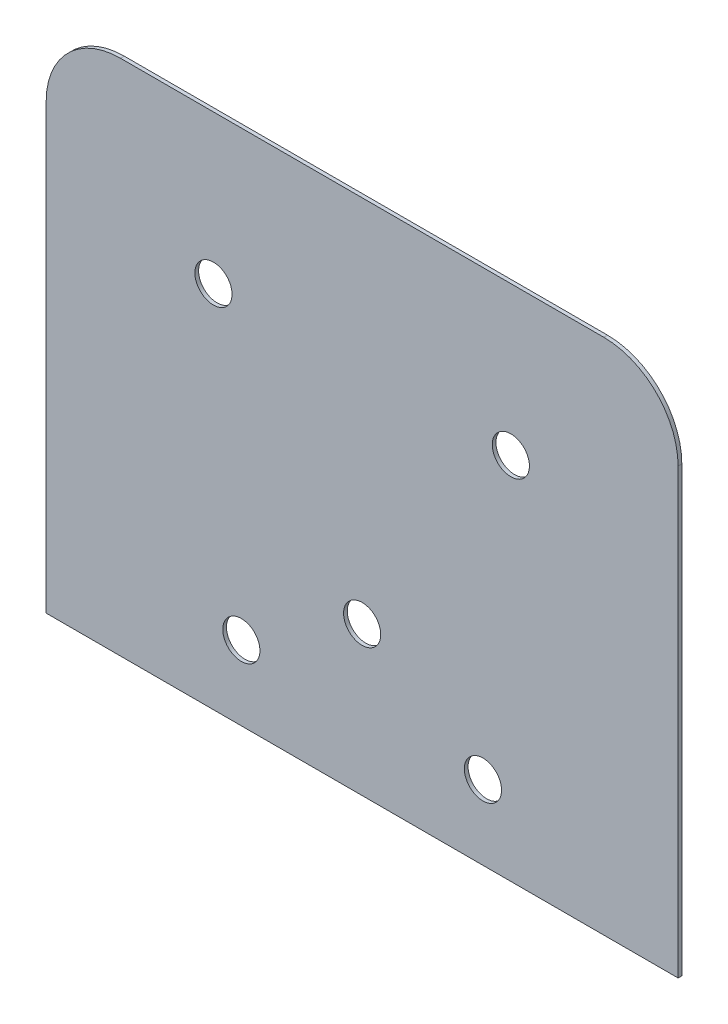
ISO-10303-21;
HEADER;
FILE_DESCRIPTION(('STEP AP214'),'2;1');
FILE_NAME('part.step','',(''),(''),'','','');
FILE_SCHEMA(('AUTOMOTIVE_DESIGN { 1 0 10303 214 1 1 1 1 }'));
ENDSEC;
DATA;
#1=APPLICATION_CONTEXT('core data for automotive mechanical design processes');
#2=APPLICATION_PROTOCOL_DEFINITION('international standard','automotive_design',2000,#1);
#3=PRODUCT_CONTEXT('',#1,'mechanical');
#4=PRODUCT('Part','Part','',(#3));
#5=PRODUCT_RELATED_PRODUCT_CATEGORY('part','',(#4));
#6=PRODUCT_DEFINITION_FORMATION('','',#4);
#7=PRODUCT_DEFINITION_CONTEXT('part definition',#1,'design');
#8=PRODUCT_DEFINITION('design','',#6,#7);
#9=PRODUCT_DEFINITION_SHAPE('','',#8);
#10=(LENGTH_UNIT() NAMED_UNIT(*) SI_UNIT(.MILLI.,.METRE.));
#11=(NAMED_UNIT(*) PLANE_ANGLE_UNIT() SI_UNIT($,.RADIAN.));
#12=(NAMED_UNIT(*) SI_UNIT($,.STERADIAN.) SOLID_ANGLE_UNIT());
#13=UNCERTAINTY_MEASURE_WITH_UNIT(LENGTH_MEASURE(1.E-05),#10,'distance_accuracy_value','');
#14=(GEOMETRIC_REPRESENTATION_CONTEXT(3) GLOBAL_UNCERTAINTY_ASSIGNED_CONTEXT((#13)) GLOBAL_UNIT_ASSIGNED_CONTEXT((#10,
#11,#12)) REPRESENTATION_CONTEXT('',''));
#15=CARTESIAN_POINT('',(0.,0.,0.));
#16=DIRECTION('',(0.,0.,1.));
#17=DIRECTION('',(1.,0.,0.));
#18=AXIS2_PLACEMENT_3D('',#15,#16,#17);
#19=CARTESIAN_POINT('',(-35.,0.,1.));
#20=DIRECTION('',(-1.,0.,0.));
#21=DIRECTION('',(0.,0.,1.));
#22=AXIS2_PLACEMENT_3D('',#19,#20,#21);
#23=PLANE('',#22);
#24=DIRECTION('',(0.,1.,0.));
#25=VECTOR('',#24,1.);
#26=CARTESIAN_POINT('',(-35.,0.,0.));
#27=LINE('',#26,#25);
#28=CARTESIAN_POINT('',(-35.,178.888220281707,0.));
#29=VERTEX_POINT('',#28);
#30=CARTESIAN_POINT('',(-35.,298.171952775904,0.));
#31=VERTEX_POINT('',#30);
#32=EDGE_CURVE('E137',#29,#31,#27,.T.);
#33=ORIENTED_EDGE('',*,*,#32,.T.);
#34=DIRECTION('',(0.,0.,-1.));
#35=VECTOR('',#34,1.);
#36=CARTESIAN_POINT('',(-35.,298.171952775904,1.));
#37=LINE('',#36,#35);
#38=CARTESIAN_POINT('',(-35.,298.171952775904,1.));
#39=VERTEX_POINT('',#38);
#40=EDGE_CURVE('E11',#39,#31,#37,.T.);
#41=ORIENTED_EDGE('',*,*,#40,.F.);
#42=DIRECTION('',(0.,1.,0.));
#43=VECTOR('',#42,1.);
#44=CARTESIAN_POINT('',(-35.,0.,1.));
#45=LINE('',#44,#43);
#46=CARTESIAN_POINT('',(-35.,178.888220281707,1.));
#47=VERTEX_POINT('',#46);
#48=EDGE_CURVE('E163',#47,#39,#45,.T.);
#49=ORIENTED_EDGE('',*,*,#48,.F.);
#50=DIRECTION('',(0.,0.,-1.));
#51=VECTOR('',#50,1.);
#52=CARTESIAN_POINT('',(-35.,178.888220281707,1.));
#53=LINE('',#52,#51);
#54=EDGE_CURVE('E118',#47,#29,#53,.T.);
#55=ORIENTED_EDGE('',*,*,#54,.T.);
#56=EDGE_LOOP('',(#33,#41,#49,#55));
#57=FACE_BOUND('',#56,.T.);
#58=ADVANCED_FACE('F39',(#57),#23,.F.);
#59=CARTESIAN_POINT('',(-55.,298.171952775904,1.));
#60=DIRECTION('',(0.,0.,-1.));
#61=DIRECTION('',(-1.,0.,0.));
#62=AXIS2_PLACEMENT_3D('',#59,#60,#61);
#63=CYLINDRICAL_SURFACE('',#62,20.);
#64=CARTESIAN_POINT('',(-55.,298.171952775904,0.));
#65=DIRECTION('',(0.,0.,1.));
#66=DIRECTION('',(1.,0.,0.));
#67=AXIS2_PLACEMENT_3D('',#64,#65,#66);
#68=CIRCLE('',#67,20.);
#69=CARTESIAN_POINT('',(-55.,318.171952775904,0.));
#70=VERTEX_POINT('',#69);
#71=EDGE_CURVE('E140',#31,#70,#68,.T.);
#72=ORIENTED_EDGE('',*,*,#71,.T.);
#73=DIRECTION('',(0.,0.,-1.));
#74=VECTOR('',#73,1.);
#75=CARTESIAN_POINT('',(-55.,318.171952775904,1.));
#76=LINE('',#75,#74);
#77=CARTESIAN_POINT('',(-55.,318.171952775904,1.));
#78=VERTEX_POINT('',#77);
#79=EDGE_CURVE('E48',#78,#70,#76,.T.);
#80=ORIENTED_EDGE('',*,*,#79,.F.);
#81=CARTESIAN_POINT('',(-55.,298.171952775904,1.));
#82=DIRECTION('',(0.,0.,1.));
#83=DIRECTION('',(1.,0.,0.));
#84=AXIS2_PLACEMENT_3D('',#81,#82,#83);
#85=CIRCLE('',#84,20.);
#86=EDGE_CURVE('E89',#39,#78,#85,.T.);
#87=ORIENTED_EDGE('',*,*,#86,.F.);
#88=ORIENTED_EDGE('',*,*,#40,.T.);
#89=EDGE_LOOP('',(#72,#80,#87,#88));
#90=FACE_BOUND('',#89,.T.);
#91=ADVANCED_FACE('F156',(#90),#63,.T.);
#92=CARTESIAN_POINT('',(0.,318.171952775904,1.));
#93=DIRECTION('',(0.,1.,0.));
#94=DIRECTION('',(0.,0.,1.));
#95=AXIS2_PLACEMENT_3D('',#92,#93,#94);
#96=PLANE('',#95);
#97=DIRECTION('',(1.,0.,0.));
#98=VECTOR('',#97,1.);
#99=CARTESIAN_POINT('',(0.,318.171952775904,0.));
#100=LINE('',#99,#98);
#101=CARTESIAN_POINT('',(-185.,318.171952775904,0.));
#102=VERTEX_POINT('',#101);
#103=EDGE_CURVE('E143',#102,#70,#100,.T.);
#104=ORIENTED_EDGE('',*,*,#103,.F.);
#105=DIRECTION('',(0.,0.,-1.));
#106=VECTOR('',#105,1.);
#107=CARTESIAN_POINT('',(-185.,318.171952775904,1.));
#108=LINE('',#107,#106);
#109=CARTESIAN_POINT('',(-185.,318.171952775904,1.));
#110=VERTEX_POINT('',#109);
#111=EDGE_CURVE('E114',#110,#102,#108,.T.);
#112=ORIENTED_EDGE('',*,*,#111,.F.);
#113=DIRECTION('',(1.,0.,0.));
#114=VECTOR('',#113,1.);
#115=CARTESIAN_POINT('',(0.,318.171952775904,1.));
#116=LINE('',#115,#114);
#117=EDGE_CURVE('E103',#110,#78,#116,.T.);
#118=ORIENTED_EDGE('',*,*,#117,.T.);
#119=ORIENTED_EDGE('',*,*,#79,.T.);
#120=EDGE_LOOP('',(#104,#112,#118,#119));
#121=FACE_BOUND('',#120,.T.);
#122=ADVANCED_FACE('F155',(#121),#96,.T.);
#123=CARTESIAN_POINT('',(-185.,298.171952775904,1.));
#124=DIRECTION('',(0.,0.,-1.));
#125=DIRECTION('',(-1.,0.,0.));
#126=AXIS2_PLACEMENT_3D('',#123,#124,#125);
#127=CYLINDRICAL_SURFACE('',#126,20.);
#128=CARTESIAN_POINT('',(-185.,298.171952775904,0.));
#129=DIRECTION('',(0.,0.,1.));
#130=DIRECTION('',(1.,0.,0.));
#131=AXIS2_PLACEMENT_3D('',#128,#129,#130);
#132=CIRCLE('',#131,20.);
#133=CARTESIAN_POINT('',(-205.,298.171952775904,0.));
#134=VERTEX_POINT('',#133);
#135=EDGE_CURVE('E110',#102,#134,#132,.T.);
#136=ORIENTED_EDGE('',*,*,#135,.T.);
#137=DIRECTION('',(0.,0.,-1.));
#138=VECTOR('',#137,1.);
#139=CARTESIAN_POINT('',(-205.,298.171952775904,1.));
#140=LINE('',#139,#138);
#141=CARTESIAN_POINT('',(-205.,298.171952775904,1.));
#142=VERTEX_POINT('',#141);
#143=EDGE_CURVE('E107',#142,#134,#140,.T.);
#144=ORIENTED_EDGE('',*,*,#143,.F.);
#145=CARTESIAN_POINT('',(-185.,298.171952775904,1.));
#146=DIRECTION('',(0.,0.,1.));
#147=DIRECTION('',(1.,0.,0.));
#148=AXIS2_PLACEMENT_3D('',#145,#146,#147);
#149=CIRCLE('',#148,20.);
#150=EDGE_CURVE('E97',#110,#142,#149,.T.);
#151=ORIENTED_EDGE('',*,*,#150,.F.);
#152=ORIENTED_EDGE('',*,*,#111,.T.);
#153=EDGE_LOOP('',(#136,#144,#151,#152));
#154=FACE_BOUND('',#153,.T.);
#155=ADVANCED_FACE('F108',(#154),#127,.T.);
#156=CARTESIAN_POINT('',(-205.,0.,1.));
#157=DIRECTION('',(-1.,0.,0.));
#158=DIRECTION('',(0.,0.,1.));
#159=AXIS2_PLACEMENT_3D('',#156,#157,#158);
#160=PLANE('',#159);
#161=DIRECTION('',(0.,1.,0.));
#162=VECTOR('',#161,1.);
#163=CARTESIAN_POINT('',(-205.,0.,0.));
#164=LINE('',#163,#162);
#165=CARTESIAN_POINT('',(-205.,178.888220281707,0.));
#166=VERTEX_POINT('',#165);
#167=EDGE_CURVE('E147',#166,#134,#164,.T.);
#168=ORIENTED_EDGE('',*,*,#167,.F.);
#169=DIRECTION('',(0.,0.,-1.));
#170=VECTOR('',#169,1.);
#171=CARTESIAN_POINT('',(-205.,178.888220281707,1.));
#172=LINE('',#171,#170);
#173=CARTESIAN_POINT('',(-205.,178.888220281707,1.));
#174=VERTEX_POINT('',#173);
#175=EDGE_CURVE('E78',#174,#166,#172,.T.);
#176=ORIENTED_EDGE('',*,*,#175,.F.);
#177=DIRECTION('',(0.,1.,0.));
#178=VECTOR('',#177,1.);
#179=CARTESIAN_POINT('',(-205.,0.,1.));
#180=LINE('',#179,#178);
#181=EDGE_CURVE('E101',#174,#142,#180,.T.);
#182=ORIENTED_EDGE('',*,*,#181,.T.);
#183=ORIENTED_EDGE('',*,*,#143,.T.);
#184=EDGE_LOOP('',(#168,#176,#182,#183));
#185=FACE_BOUND('',#184,.T.);
#186=ADVANCED_FACE('F116',(#185),#160,.T.);
#187=CARTESIAN_POINT('',(-160.,278.171952775904,1.));
#188=DIRECTION('',(0.,0.,-1.));
#189=DIRECTION('',(-1.,0.,0.));
#190=AXIS2_PLACEMENT_3D('',#187,#188,#189);
#191=CYLINDRICAL_SURFACE('',#190,4.99999999999999);
#192=CARTESIAN_POINT('',(-160.,278.171952775904,1.));
#193=DIRECTION('',(0.,0.,1.));
#194=DIRECTION('',(1.,0.,0.));
#195=AXIS2_PLACEMENT_3D('',#192,#193,#194);
#196=CIRCLE('',#195,4.99999999999999);
#197=CARTESIAN_POINT('',(-155.,278.171952775904,1.));
#198=VERTEX_POINT('',#197);
#199=EDGE_CURVE('E338',#198,#198,#196,.T.);
#200=ORIENTED_EDGE('',*,*,#199,.T.);
#201=EDGE_LOOP('',(#200));
#202=FACE_BOUND('',#201,.T.);
#203=CARTESIAN_POINT('',(-160.,278.171952775904,0.));
#204=DIRECTION('',(0.,0.,1.));
#205=DIRECTION('',(1.,0.,0.));
#206=AXIS2_PLACEMENT_3D('',#203,#204,#205);
#207=CIRCLE('',#206,4.99999999999999);
#208=CARTESIAN_POINT('',(-155.,278.171952775904,0.));
#209=VERTEX_POINT('',#208);
#210=EDGE_CURVE('E134',#209,#209,#207,.T.);
#211=ORIENTED_EDGE('',*,*,#210,.F.);
#212=EDGE_LOOP('',(#211));
#213=FACE_BOUND('',#212,.T.);
#214=ADVANCED_FACE('F185',(#202,#213),#191,.F.);
#215=CARTESIAN_POINT('',(-80.,278.171952775904,1.));
#216=DIRECTION('',(0.,0.,-1.));
#217=DIRECTION('',(-1.,0.,0.));
#218=AXIS2_PLACEMENT_3D('',#215,#216,#217);
#219=CYLINDRICAL_SURFACE('',#218,5.00000000000001);
#220=CARTESIAN_POINT('',(-80.,278.171952775904,1.));
#221=DIRECTION('',(0.,0.,1.));
#222=DIRECTION('',(1.,0.,0.));
#223=AXIS2_PLACEMENT_3D('',#220,#221,#222);
#224=CIRCLE('',#223,5.00000000000001);
#225=CARTESIAN_POINT('',(-75.,278.171952775904,1.));
#226=VERTEX_POINT('',#225);
#227=EDGE_CURVE('E331',#226,#226,#224,.T.);
#228=ORIENTED_EDGE('',*,*,#227,.T.);
#229=EDGE_LOOP('',(#228));
#230=FACE_BOUND('',#229,.T.);
#231=CARTESIAN_POINT('',(-80.,278.171952775904,0.));
#232=DIRECTION('',(0.,0.,1.));
#233=DIRECTION('',(1.,0.,0.));
#234=AXIS2_PLACEMENT_3D('',#231,#232,#233);
#235=CIRCLE('',#234,5.00000000000001);
#236=CARTESIAN_POINT('',(-75.,278.171952775904,0.));
#237=VERTEX_POINT('',#236);
#238=EDGE_CURVE('E131',#237,#237,#235,.T.);
#239=ORIENTED_EDGE('',*,*,#238,.F.);
#240=EDGE_LOOP('',(#239));
#241=FACE_BOUND('',#240,.T.);
#242=ADVANCED_FACE('F188',(#230,#241),#219,.F.);
#243=CARTESIAN_POINT('',(-152.5,198.888220281707,1.));
#244=DIRECTION('',(0.,0.,-1.));
#245=DIRECTION('',(-1.,0.,0.));
#246=AXIS2_PLACEMENT_3D('',#243,#244,#245);
#247=CYLINDRICAL_SURFACE('',#246,5.00000000000002);
#248=CARTESIAN_POINT('',(-152.5,198.888220281707,1.));
#249=DIRECTION('',(0.,0.,1.));
#250=DIRECTION('',(1.,0.,0.));
#251=AXIS2_PLACEMENT_3D('',#248,#249,#250);
#252=CIRCLE('',#251,5.00000000000002);
#253=CARTESIAN_POINT('',(-147.5,198.888220281707,1.));
#254=VERTEX_POINT('',#253);
#255=EDGE_CURVE('E328',#254,#254,#252,.T.);
#256=ORIENTED_EDGE('',*,*,#255,.T.);
#257=EDGE_LOOP('',(#256));
#258=FACE_BOUND('',#257,.T.);
#259=CARTESIAN_POINT('',(-152.5,198.888220281707,0.));
#260=DIRECTION('',(0.,0.,1.));
#261=DIRECTION('',(1.,0.,0.));
#262=AXIS2_PLACEMENT_3D('',#259,#260,#261);
#263=CIRCLE('',#262,5.00000000000002);
#264=CARTESIAN_POINT('',(-147.5,198.888220281707,0.));
#265=VERTEX_POINT('',#264);
#266=EDGE_CURVE('E128',#265,#265,#263,.T.);
#267=ORIENTED_EDGE('',*,*,#266,.F.);
#268=EDGE_LOOP('',(#267));
#269=FACE_BOUND('',#268,.T.);
#270=ADVANCED_FACE('F192',(#258,#269),#247,.F.);
#271=CARTESIAN_POINT('',(-120.,218.888220281707,1.));
#272=DIRECTION('',(0.,0.,-1.));
#273=DIRECTION('',(-1.,0.,0.));
#274=AXIS2_PLACEMENT_3D('',#271,#272,#273);
#275=CYLINDRICAL_SURFACE('',#274,5.00000000000001);
#276=CARTESIAN_POINT('',(-120.,218.888220281707,1.));
#277=DIRECTION('',(0.,0.,1.));
#278=DIRECTION('',(1.,0.,0.));
#279=AXIS2_PLACEMENT_3D('',#276,#277,#278);
#280=CIRCLE('',#279,5.00000000000001);
#281=CARTESIAN_POINT('',(-115.,218.888220281707,1.));
#282=VERTEX_POINT('',#281);
#283=EDGE_CURVE('E203',#282,#282,#280,.T.);
#284=ORIENTED_EDGE('',*,*,#283,.T.);
#285=EDGE_LOOP('',(#284));
#286=FACE_BOUND('',#285,.T.);
#287=CARTESIAN_POINT('',(-120.,218.888220281707,0.));
#288=DIRECTION('',(0.,0.,1.));
#289=DIRECTION('',(1.,0.,0.));
#290=AXIS2_PLACEMENT_3D('',#287,#288,#289);
#291=CIRCLE('',#290,5.00000000000001);
#292=CARTESIAN_POINT('',(-115.,218.888220281707,0.));
#293=VERTEX_POINT('',#292);
#294=EDGE_CURVE('E125',#293,#293,#291,.T.);
#295=ORIENTED_EDGE('',*,*,#294,.F.);
#296=EDGE_LOOP('',(#295));
#297=FACE_BOUND('',#296,.T.);
#298=ADVANCED_FACE('F173',(#286,#297),#275,.F.);
#299=CARTESIAN_POINT('',(-87.5,198.888220281707,1.));
#300=DIRECTION('',(0.,0.,-1.));
#301=DIRECTION('',(-1.,0.,0.));
#302=AXIS2_PLACEMENT_3D('',#299,#300,#301);
#303=CYLINDRICAL_SURFACE('',#302,5.00000000000001);
#304=CARTESIAN_POINT('',(-87.5,198.888220281707,1.));
#305=DIRECTION('',(0.,0.,1.));
#306=DIRECTION('',(1.,0.,0.));
#307=AXIS2_PLACEMENT_3D('',#304,#305,#306);
#308=CIRCLE('',#307,5.00000000000001);
#309=CARTESIAN_POINT('',(-82.5,198.888220281707,1.));
#310=VERTEX_POINT('',#309);
#311=EDGE_CURVE('E150',#310,#310,#308,.T.);
#312=ORIENTED_EDGE('',*,*,#311,.T.);
#313=EDGE_LOOP('',(#312));
#314=FACE_BOUND('',#313,.T.);
#315=CARTESIAN_POINT('',(-87.5,198.888220281707,0.));
#316=DIRECTION('',(0.,0.,1.));
#317=DIRECTION('',(1.,0.,0.));
#318=AXIS2_PLACEMENT_3D('',#315,#316,#317);
#319=CIRCLE('',#318,5.00000000000001);
#320=CARTESIAN_POINT('',(-82.5,198.888220281707,0.));
#321=VERTEX_POINT('',#320);
#322=EDGE_CURVE('E122',#321,#321,#319,.T.);
#323=ORIENTED_EDGE('',*,*,#322,.F.);
#324=EDGE_LOOP('',(#323));
#325=FACE_BOUND('',#324,.T.);
#326=ADVANCED_FACE('F41',(#314,#325),#303,.F.);
#327=CARTESIAN_POINT('',(0.,178.888220281707,1.));
#328=DIRECTION('',(0.,1.,0.));
#329=DIRECTION('',(0.,0.,1.));
#330=AXIS2_PLACEMENT_3D('',#327,#328,#329);
#331=PLANE('',#330);
#332=DIRECTION('',(1.,0.,0.));
#333=VECTOR('',#332,1.);
#334=CARTESIAN_POINT('',(0.,178.888220281707,0.));
#335=LINE('',#334,#333);
#336=EDGE_CURVE('E81',#166,#29,#335,.T.);
#337=ORIENTED_EDGE('',*,*,#336,.T.);
#338=ORIENTED_EDGE('',*,*,#54,.F.);
#339=DIRECTION('',(1.,0.,0.));
#340=VECTOR('',#339,1.);
#341=CARTESIAN_POINT('',(0.,178.888220281707,1.));
#342=LINE('',#341,#340);
#343=EDGE_CURVE('E56',#174,#47,#342,.T.);
#344=ORIENTED_EDGE('',*,*,#343,.F.);
#345=ORIENTED_EDGE('',*,*,#175,.T.);
#346=EDGE_LOOP('',(#337,#338,#344,#345));
#347=FACE_BOUND('',#346,.T.);
#348=ADVANCED_FACE('F164',(#347),#331,.F.);
#349=CARTESIAN_POINT('',(0.,0.,1.));
#350=DIRECTION('',(0.,0.,1.));
#351=DIRECTION('',(1.,0.,0.));
#352=AXIS2_PLACEMENT_3D('',#349,#350,#351);
#353=PLANE('',#352);
#354=ORIENTED_EDGE('',*,*,#311,.F.);
#355=EDGE_LOOP('',(#354));
#356=FACE_BOUND('',#355,.T.);
#357=ORIENTED_EDGE('',*,*,#283,.F.);
#358=EDGE_LOOP('',(#357));
#359=FACE_BOUND('',#358,.T.);
#360=ORIENTED_EDGE('',*,*,#255,.F.);
#361=EDGE_LOOP('',(#360));
#362=FACE_BOUND('',#361,.T.);
#363=ORIENTED_EDGE('',*,*,#227,.F.);
#364=EDGE_LOOP('',(#363));
#365=FACE_BOUND('',#364,.T.);
#366=ORIENTED_EDGE('',*,*,#199,.F.);
#367=EDGE_LOOP('',(#366));
#368=FACE_BOUND('',#367,.T.);
#369=ORIENTED_EDGE('',*,*,#48,.T.);
#370=ORIENTED_EDGE('',*,*,#86,.T.);
#371=ORIENTED_EDGE('',*,*,#117,.F.);
#372=ORIENTED_EDGE('',*,*,#150,.T.);
#373=ORIENTED_EDGE('',*,*,#181,.F.);
#374=ORIENTED_EDGE('',*,*,#343,.T.);
#375=EDGE_LOOP('',(#369,#370,#371,#372,#373,#374));
#376=FACE_BOUND('',#375,.T.);
#377=ADVANCED_FACE('F99',(#356,#359,#362,#365,#368,#376),#353,.T.);
#378=CARTESIAN_POINT('',(0.,0.,0.));
#379=DIRECTION('',(0.,0.,1.));
#380=DIRECTION('',(1.,0.,0.));
#381=AXIS2_PLACEMENT_3D('',#378,#379,#380);
#382=PLANE('',#381);
#383=ORIENTED_EDGE('',*,*,#322,.T.);
#384=EDGE_LOOP('',(#383));
#385=FACE_BOUND('',#384,.T.);
#386=ORIENTED_EDGE('',*,*,#294,.T.);
#387=EDGE_LOOP('',(#386));
#388=FACE_BOUND('',#387,.T.);
#389=ORIENTED_EDGE('',*,*,#266,.T.);
#390=EDGE_LOOP('',(#389));
#391=FACE_BOUND('',#390,.T.);
#392=ORIENTED_EDGE('',*,*,#238,.T.);
#393=EDGE_LOOP('',(#392));
#394=FACE_BOUND('',#393,.T.);
#395=ORIENTED_EDGE('',*,*,#210,.T.);
#396=EDGE_LOOP('',(#395));
#397=FACE_BOUND('',#396,.T.);
#398=ORIENTED_EDGE('',*,*,#32,.F.);
#399=ORIENTED_EDGE('',*,*,#336,.F.);
#400=ORIENTED_EDGE('',*,*,#167,.T.);
#401=ORIENTED_EDGE('',*,*,#135,.F.);
#402=ORIENTED_EDGE('',*,*,#103,.T.);
#403=ORIENTED_EDGE('',*,*,#71,.F.);
#404=EDGE_LOOP('',(#398,#399,#400,#401,#402,#403));
#405=FACE_BOUND('',#404,.T.);
#406=ADVANCED_FACE('F160',(#385,#388,#391,#394,#397,#405),#382,.F.);
#407=CLOSED_SHELL('',(#58,#91,#122,#155,#186,#214,#242,#270,#298,#326,#348,#377,#406));
#408=MANIFOLD_SOLID_BREP('B2',#407);
#409=ADVANCED_BREP_SHAPE_REPRESENTATION('',(#18,#408),#14);
#410=SHAPE_DEFINITION_REPRESENTATION(#9,#409);
ENDSEC;
END-ISO-10303-21;
